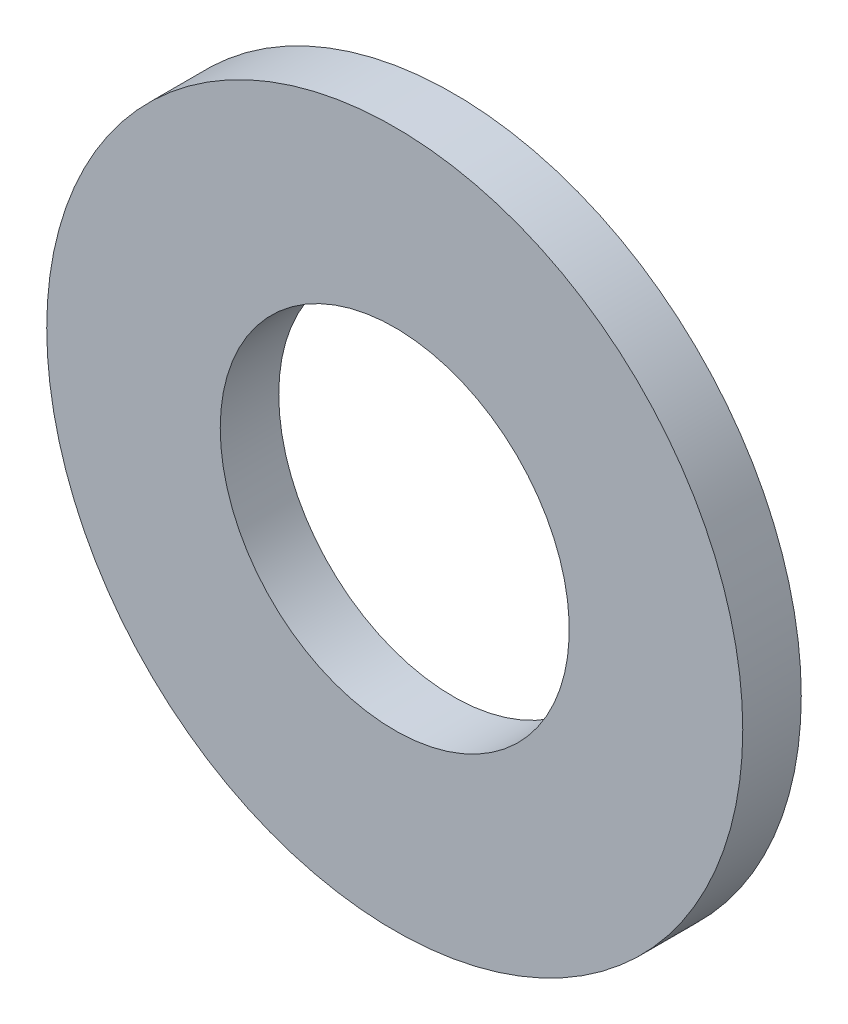
ISO-10303-21;
HEADER;
FILE_DESCRIPTION(('STEP AP214'),'2;1');
FILE_NAME('part.step','',(''),(''),'','','');
FILE_SCHEMA(('AUTOMOTIVE_DESIGN { 1 0 10303 214 1 1 1 1 }'));
ENDSEC;
DATA;
#1=APPLICATION_CONTEXT('core data for automotive mechanical design processes');
#2=APPLICATION_PROTOCOL_DEFINITION('international standard','automotive_design',2000,#1);
#3=PRODUCT_CONTEXT('',#1,'mechanical');
#4=PRODUCT('Part','Part','',(#3));
#5=PRODUCT_RELATED_PRODUCT_CATEGORY('part','',(#4));
#6=PRODUCT_DEFINITION_FORMATION('','',#4);
#7=PRODUCT_DEFINITION_CONTEXT('part definition',#1,'design');
#8=PRODUCT_DEFINITION('design','',#6,#7);
#9=PRODUCT_DEFINITION_SHAPE('','',#8);
#10=(LENGTH_UNIT() NAMED_UNIT(*) SI_UNIT(.MILLI.,.METRE.));
#11=(NAMED_UNIT(*) PLANE_ANGLE_UNIT() SI_UNIT($,.RADIAN.));
#12=(NAMED_UNIT(*) SI_UNIT($,.STERADIAN.) SOLID_ANGLE_UNIT());
#13=UNCERTAINTY_MEASURE_WITH_UNIT(LENGTH_MEASURE(1.E-05),#10,'distance_accuracy_value','');
#14=(GEOMETRIC_REPRESENTATION_CONTEXT(3) GLOBAL_UNCERTAINTY_ASSIGNED_CONTEXT((#13)) GLOBAL_UNIT_ASSIGNED_CONTEXT((#10,
#11,#12)) REPRESENTATION_CONTEXT('',''));
#15=CARTESIAN_POINT('',(0.,0.,0.));
#16=DIRECTION('',(0.,0.,1.));
#17=DIRECTION('',(1.,0.,0.));
#18=AXIS2_PLACEMENT_3D('',#15,#16,#17);
#19=CARTESIAN_POINT('',(0.,0.,0.));
#20=DIRECTION('',(0.,0.,-1.));
#21=DIRECTION('',(-1.,0.,0.));
#22=AXIS2_PLACEMENT_3D('',#19,#20,#21);
#23=PLANE('',#22);
#24=CARTESIAN_POINT('',(0.,0.,0.));
#25=DIRECTION('',(0.,0.,-1.));
#26=DIRECTION('',(-1.,0.,0.));
#27=AXIS2_PLACEMENT_3D('',#24,#25,#26);
#28=CIRCLE('',#27,8.763);
#29=CARTESIAN_POINT('',(-8.763,0.,0.));
#30=VERTEX_POINT('',#29);
#31=EDGE_CURVE('E26',#30,#30,#28,.F.);
#32=ORIENTED_EDGE('',*,*,#31,.F.);
#33=EDGE_LOOP('',(#32));
#34=FACE_BOUND('',#33,.T.);
#35=CARTESIAN_POINT('',(0.,0.,0.));
#36=DIRECTION('',(0.,0.,-1.));
#37=DIRECTION('',(-1.,0.,0.));
#38=AXIS2_PLACEMENT_3D('',#35,#36,#37);
#39=CIRCLE('',#38,4.3942);
#40=CARTESIAN_POINT('',(-4.3942,0.,0.));
#41=VERTEX_POINT('',#40);
#42=EDGE_CURVE('E17',#41,#41,#39,.F.);
#43=ORIENTED_EDGE('',*,*,#42,.T.);
#44=EDGE_LOOP('',(#43));
#45=FACE_BOUND('',#44,.T.);
#46=ADVANCED_FACE('F14',(#34,#45),#23,.T.);
#47=CARTESIAN_POINT('',(0.,0.,1.4732));
#48=DIRECTION('',(0.,0.,-1.));
#49=DIRECTION('',(-1.,0.,0.));
#50=AXIS2_PLACEMENT_3D('',#47,#48,#49);
#51=CYLINDRICAL_SURFACE('',#50,4.3942);
#52=CARTESIAN_POINT('',(0.,0.,1.4732));
#53=DIRECTION('',(0.,0.,-1.));
#54=DIRECTION('',(-1.,0.,0.));
#55=AXIS2_PLACEMENT_3D('',#52,#53,#54);
#56=CIRCLE('',#55,4.3942);
#57=CARTESIAN_POINT('',(-4.3942,0.,1.4732));
#58=VERTEX_POINT('',#57);
#59=EDGE_CURVE('E21',#58,#58,#56,.F.);
#60=ORIENTED_EDGE('',*,*,#59,.T.);
#61=EDGE_LOOP('',(#60));
#62=FACE_BOUND('',#61,.T.);
#63=ORIENTED_EDGE('',*,*,#42,.F.);
#64=EDGE_LOOP('',(#63));
#65=FACE_BOUND('',#64,.T.);
#66=ADVANCED_FACE('F35',(#62,#65),#51,.F.);
#67=CARTESIAN_POINT('',(0.,0.,1.4732));
#68=DIRECTION('',(0.,0.,-1.));
#69=DIRECTION('',(-1.,0.,0.));
#70=AXIS2_PLACEMENT_3D('',#67,#68,#69);
#71=CYLINDRICAL_SURFACE('',#70,8.763);
#72=ORIENTED_EDGE('',*,*,#31,.T.);
#73=EDGE_LOOP('',(#72));
#74=FACE_BOUND('',#73,.T.);
#75=CARTESIAN_POINT('',(0.,0.,1.4732));
#76=DIRECTION('',(0.,0.,-1.));
#77=DIRECTION('',(-1.,0.,0.));
#78=AXIS2_PLACEMENT_3D('',#75,#76,#77);
#79=CIRCLE('',#78,8.763);
#80=CARTESIAN_POINT('',(-8.763,0.,1.4732));
#81=VERTEX_POINT('',#80);
#82=EDGE_CURVE('E9',#81,#81,#79,.T.);
#83=ORIENTED_EDGE('',*,*,#82,.T.);
#84=EDGE_LOOP('',(#83));
#85=FACE_BOUND('',#84,.T.);
#86=ADVANCED_FACE('F37',(#74,#85),#71,.T.);
#87=CARTESIAN_POINT('',(0.,0.,1.4732));
#88=DIRECTION('',(0.,0.,-1.));
#89=DIRECTION('',(-1.,0.,0.));
#90=AXIS2_PLACEMENT_3D('',#87,#88,#89);
#91=PLANE('',#90);
#92=ORIENTED_EDGE('',*,*,#82,.F.);
#93=EDGE_LOOP('',(#92));
#94=FACE_BOUND('',#93,.T.);
#95=ORIENTED_EDGE('',*,*,#59,.F.);
#96=EDGE_LOOP('',(#95));
#97=FACE_BOUND('',#96,.T.);
#98=ADVANCED_FACE('F44',(#94,#97),#91,.F.);
#99=CLOSED_SHELL('',(#46,#66,#86,#98));
#100=MANIFOLD_SOLID_BREP('B1',#99);
#101=ADVANCED_BREP_SHAPE_REPRESENTATION('',(#18,#100),#14);
#102=SHAPE_DEFINITION_REPRESENTATION(#9,#101);
ENDSEC;
END-ISO-10303-21;
